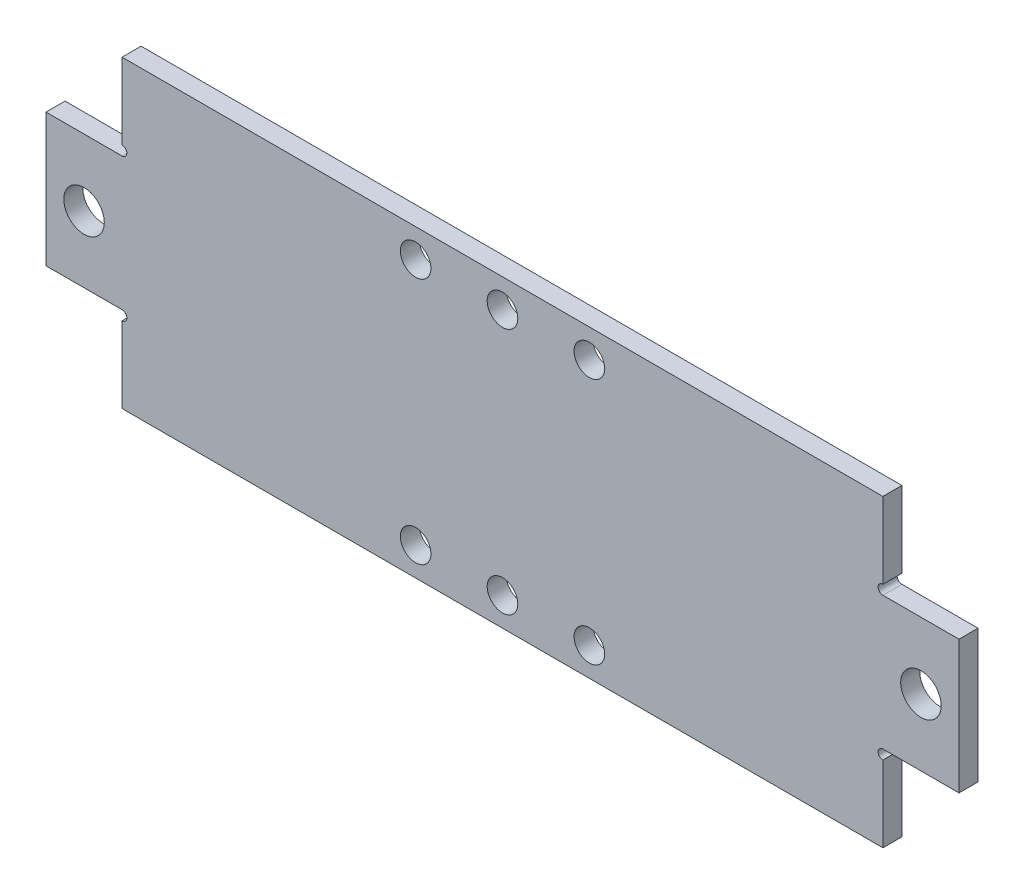
ISO-10303-21;
HEADER;
FILE_DESCRIPTION(('STEP AP214'),'2;1');
FILE_NAME('part.step','',(''),(''),'','','');
FILE_SCHEMA(('AUTOMOTIVE_DESIGN { 1 0 10303 214 1 1 1 1 }'));
ENDSEC;
DATA;
#1=APPLICATION_CONTEXT('core data for automotive mechanical design processes');
#2=APPLICATION_PROTOCOL_DEFINITION('international standard','automotive_design',2000,#1);
#3=PRODUCT_CONTEXT('',#1,'mechanical');
#4=PRODUCT('Part','Part','',(#3));
#5=PRODUCT_RELATED_PRODUCT_CATEGORY('part','',(#4));
#6=PRODUCT_DEFINITION_FORMATION('','',#4);
#7=PRODUCT_DEFINITION_CONTEXT('part definition',#1,'design');
#8=PRODUCT_DEFINITION('design','',#6,#7);
#9=PRODUCT_DEFINITION_SHAPE('','',#8);
#10=(LENGTH_UNIT() NAMED_UNIT(*) SI_UNIT(.MILLI.,.METRE.));
#11=(NAMED_UNIT(*) PLANE_ANGLE_UNIT() SI_UNIT($,.RADIAN.));
#12=(NAMED_UNIT(*) SI_UNIT($,.STERADIAN.) SOLID_ANGLE_UNIT());
#13=UNCERTAINTY_MEASURE_WITH_UNIT(LENGTH_MEASURE(1.E-05),#10,'distance_accuracy_value','');
#14=(GEOMETRIC_REPRESENTATION_CONTEXT(3) GLOBAL_UNCERTAINTY_ASSIGNED_CONTEXT((#13)) GLOBAL_UNIT_ASSIGNED_CONTEXT((#10,
#11,#12)) REPRESENTATION_CONTEXT('',''));
#15=CARTESIAN_POINT('',(0.,0.,0.));
#16=DIRECTION('',(0.,0.,1.));
#17=DIRECTION('',(1.,0.,0.));
#18=AXIS2_PLACEMENT_3D('',#15,#16,#17);
#19=CARTESIAN_POINT('',(0.,0.,3.175));
#20=DIRECTION('',(1.,0.,0.));
#21=DIRECTION('',(0.,0.,-1.));
#22=AXIS2_PLACEMENT_3D('',#19,#20,#21);
#23=PLANE('',#22);
#24=DIRECTION('',(0.,-1.,0.));
#25=VECTOR('',#24,1.);
#26=CARTESIAN_POINT('',(0.,0.,0.));
#27=LINE('',#26,#25);
#28=CARTESIAN_POINT('',(0.,36.5125,0.));
#29=VERTEX_POINT('',#28);
#30=CARTESIAN_POINT('',(0.,14.2875,0.));
#31=VERTEX_POINT('',#30);
#32=EDGE_CURVE('E229',#29,#31,#27,.T.);
#33=ORIENTED_EDGE('',*,*,#32,.T.);
#34=DIRECTION('',(0.,0.,1.));
#35=VECTOR('',#34,1.);
#36=CARTESIAN_POINT('',(0.,14.2875,0.));
#37=LINE('',#36,#35);
#38=CARTESIAN_POINT('',(0.,14.2875,3.175));
#39=VERTEX_POINT('',#38);
#40=EDGE_CURVE('E208',#31,#39,#37,.T.);
#41=ORIENTED_EDGE('',*,*,#40,.T.);
#42=DIRECTION('',(0.,-1.,0.));
#43=VECTOR('',#42,1.);
#44=CARTESIAN_POINT('',(0.,0.,3.175));
#45=LINE('',#44,#43);
#46=CARTESIAN_POINT('',(0.,36.5125,3.175));
#47=VERTEX_POINT('',#46);
#48=EDGE_CURVE('E233',#47,#39,#45,.T.);
#49=ORIENTED_EDGE('',*,*,#48,.F.);
#50=DIRECTION('',(0.,0.,1.));
#51=VECTOR('',#50,1.);
#52=CARTESIAN_POINT('',(0.,36.5125,0.));
#53=LINE('',#52,#51);
#54=EDGE_CURVE('E222',#29,#47,#53,.T.);
#55=ORIENTED_EDGE('',*,*,#54,.F.);
#56=EDGE_LOOP('',(#33,#41,#49,#55));
#57=FACE_BOUND('',#56,.T.);
#58=ADVANCED_FACE('F33',(#57),#23,.F.);
#59=CARTESIAN_POINT('',(0.,0.,3.175));
#60=DIRECTION('',(0.,1.,0.));
#61=DIRECTION('',(0.,0.,1.));
#62=AXIS2_PLACEMENT_3D('',#59,#60,#61);
#63=PLANE('',#62);
#64=DIRECTION('',(1.,0.,0.));
#65=VECTOR('',#64,1.);
#66=CARTESIAN_POINT('',(0.,0.,0.));
#67=LINE('',#66,#65);
#68=CARTESIAN_POINT('',(12.7,0.,0.));
#69=VERTEX_POINT('',#68);
#70=CARTESIAN_POINT('',(139.7,0.,0.));
#71=VERTEX_POINT('',#70);
#72=EDGE_CURVE('E246',#69,#71,#67,.T.);
#73=ORIENTED_EDGE('',*,*,#72,.T.);
#74=DIRECTION('',(0.,0.,1.));
#75=VECTOR('',#74,1.);
#76=CARTESIAN_POINT('',(139.7,0.,0.));
#77=LINE('',#76,#75);
#78=CARTESIAN_POINT('',(139.7,0.,3.175));
#79=VERTEX_POINT('',#78);
#80=EDGE_CURVE('E190',#71,#79,#77,.T.);
#81=ORIENTED_EDGE('',*,*,#80,.T.);
#82=DIRECTION('',(1.,0.,0.));
#83=VECTOR('',#82,1.);
#84=CARTESIAN_POINT('',(0.,0.,3.175));
#85=LINE('',#84,#83);
#86=CARTESIAN_POINT('',(12.7,0.,3.175));
#87=VERTEX_POINT('',#86);
#88=EDGE_CURVE('E236',#87,#79,#85,.T.);
#89=ORIENTED_EDGE('',*,*,#88,.F.);
#90=DIRECTION('',(0.,0.,1.));
#91=VECTOR('',#90,1.);
#92=CARTESIAN_POINT('',(12.7,0.,0.));
#93=LINE('',#92,#91);
#94=EDGE_CURVE('E204',#69,#87,#93,.T.);
#95=ORIENTED_EDGE('',*,*,#94,.F.);
#96=EDGE_LOOP('',(#73,#81,#89,#95));
#97=FACE_BOUND('',#96,.T.);
#98=ADVANCED_FACE('F266',(#97),#63,.F.);
#99=CARTESIAN_POINT('',(152.4,0.,3.175));
#100=DIRECTION('',(-1.,0.,0.));
#101=DIRECTION('',(0.,0.,1.));
#102=AXIS2_PLACEMENT_3D('',#99,#100,#101);
#103=PLANE('',#102);
#104=DIRECTION('',(0.,1.,0.));
#105=VECTOR('',#104,1.);
#106=CARTESIAN_POINT('',(152.4,0.,0.));
#107=LINE('',#106,#105);
#108=CARTESIAN_POINT('',(152.4,14.2875,0.));
#109=VERTEX_POINT('',#108);
#110=CARTESIAN_POINT('',(152.4,36.5125,0.));
#111=VERTEX_POINT('',#110);
#112=EDGE_CURVE('E249',#109,#111,#107,.T.);
#113=ORIENTED_EDGE('',*,*,#112,.T.);
#114=DIRECTION('',(0.,0.,1.));
#115=VECTOR('',#114,1.);
#116=CARTESIAN_POINT('',(152.4,36.5125,0.));
#117=LINE('',#116,#115);
#118=CARTESIAN_POINT('',(152.4,36.5125,3.175));
#119=VERTEX_POINT('',#118);
#120=EDGE_CURVE('E173',#111,#119,#117,.T.);
#121=ORIENTED_EDGE('',*,*,#120,.T.);
#122=DIRECTION('',(0.,1.,0.));
#123=VECTOR('',#122,1.);
#124=CARTESIAN_POINT('',(152.4,0.,3.175));
#125=LINE('',#124,#123);
#126=CARTESIAN_POINT('',(152.4,14.2875,3.175));
#127=VERTEX_POINT('',#126);
#128=EDGE_CURVE('E240',#127,#119,#125,.T.);
#129=ORIENTED_EDGE('',*,*,#128,.F.);
#130=DIRECTION('',(0.,0.,1.));
#131=VECTOR('',#130,1.);
#132=CARTESIAN_POINT('',(152.4,14.2875,0.));
#133=LINE('',#132,#131);
#134=EDGE_CURVE('E186',#109,#127,#133,.T.);
#135=ORIENTED_EDGE('',*,*,#134,.F.);
#136=EDGE_LOOP('',(#113,#121,#129,#135));
#137=FACE_BOUND('',#136,.T.);
#138=ADVANCED_FACE('F288',(#137),#103,.F.);
#139=CARTESIAN_POINT('',(0.,50.8,3.175));
#140=DIRECTION('',(0.,-1.,0.));
#141=DIRECTION('',(0.,0.,-1.));
#142=AXIS2_PLACEMENT_3D('',#139,#140,#141);
#143=PLANE('',#142);
#144=DIRECTION('',(-1.,0.,0.));
#145=VECTOR('',#144,1.);
#146=CARTESIAN_POINT('',(0.,50.8,3.175));
#147=LINE('',#146,#145);
#148=CARTESIAN_POINT('',(139.7,50.8,3.175));
#149=VERTEX_POINT('',#148);
#150=CARTESIAN_POINT('',(12.7,50.8,3.175));
#151=VERTEX_POINT('',#150);
#152=EDGE_CURVE('E242',#149,#151,#147,.T.);
#153=ORIENTED_EDGE('',*,*,#152,.F.);
#154=DIRECTION('',(0.,0.,1.));
#155=VECTOR('',#154,1.);
#156=CARTESIAN_POINT('',(139.7,50.8,0.));
#157=LINE('',#156,#155);
#158=CARTESIAN_POINT('',(139.7,50.8,0.));
#159=VERTEX_POINT('',#158);
#160=EDGE_CURVE('E161',#159,#149,#157,.T.);
#161=ORIENTED_EDGE('',*,*,#160,.F.);
#162=DIRECTION('',(-1.,0.,0.));
#163=VECTOR('',#162,1.);
#164=CARTESIAN_POINT('',(0.,50.8,0.));
#165=LINE('',#164,#163);
#166=CARTESIAN_POINT('',(12.7,50.8,0.));
#167=VERTEX_POINT('',#166);
#168=EDGE_CURVE('E237',#159,#167,#165,.T.);
#169=ORIENTED_EDGE('',*,*,#168,.T.);
#170=DIRECTION('',(0.,0.,1.));
#171=VECTOR('',#170,1.);
#172=CARTESIAN_POINT('',(12.7,50.8,0.));
#173=LINE('',#172,#171);
#174=EDGE_CURVE('E226',#167,#151,#173,.T.);
#175=ORIENTED_EDGE('',*,*,#174,.T.);
#176=EDGE_LOOP('',(#153,#161,#169,#175));
#177=FACE_BOUND('',#176,.T.);
#178=ADVANCED_FACE('F353',(#177),#143,.F.);
#179=CARTESIAN_POINT('',(0.,0.,3.175));
#180=DIRECTION('',(0.,0.,-1.));
#181=DIRECTION('',(-1.,0.,0.));
#182=AXIS2_PLACEMENT_3D('',#179,#180,#181);
#183=PLANE('',#182);
#184=CARTESIAN_POINT('',(76.2,4.7625,3.175));
#185=DIRECTION('',(0.,0.,1.));
#186=DIRECTION('',(1.,0.,0.));
#187=AXIS2_PLACEMENT_3D('',#184,#185,#186);
#188=CIRCLE('',#187,2.55270000000001);
#189=CARTESIAN_POINT('',(78.7527,4.7625,3.175));
#190=VERTEX_POINT('',#189);
#191=EDGE_CURVE('E345',#190,#190,#188,.T.);
#192=ORIENTED_EDGE('',*,*,#191,.F.);
#193=EDGE_LOOP('',(#192));
#194=FACE_BOUND('',#193,.T.);
#195=CARTESIAN_POINT('',(90.7,4.76250000000001,3.175));
#196=DIRECTION('',(0.,0.,1.));
#197=DIRECTION('',(1.,0.,0.));
#198=AXIS2_PLACEMENT_3D('',#195,#196,#197);
#199=CIRCLE('',#198,2.55270000000001);
#200=CARTESIAN_POINT('',(93.2527,4.76250000000001,3.175));
#201=VERTEX_POINT('',#200);
#202=EDGE_CURVE('E339',#201,#201,#199,.T.);
#203=ORIENTED_EDGE('',*,*,#202,.F.);
#204=EDGE_LOOP('',(#203));
#205=FACE_BOUND('',#204,.T.);
#206=CARTESIAN_POINT('',(61.7,4.7625,3.175));
#207=DIRECTION('',(0.,0.,1.));
#208=DIRECTION('',(1.,0.,0.));
#209=AXIS2_PLACEMENT_3D('',#206,#207,#208);
#210=CIRCLE('',#209,2.55270000000001);
#211=CARTESIAN_POINT('',(64.2527,4.7625,3.175));
#212=VERTEX_POINT('',#211);
#213=EDGE_CURVE('E333',#212,#212,#210,.T.);
#214=ORIENTED_EDGE('',*,*,#213,.F.);
#215=EDGE_LOOP('',(#214));
#216=FACE_BOUND('',#215,.T.);
#217=CARTESIAN_POINT('',(61.7,46.0375,3.175));
#218=DIRECTION('',(0.,0.,1.));
#219=DIRECTION('',(1.,0.,0.));
#220=AXIS2_PLACEMENT_3D('',#217,#218,#219);
#221=CIRCLE('',#220,2.55270000000001);
#222=CARTESIAN_POINT('',(64.2527,46.0375,3.175));
#223=VERTEX_POINT('',#222);
#224=EDGE_CURVE('E327',#223,#223,#221,.T.);
#225=ORIENTED_EDGE('',*,*,#224,.F.);
#226=EDGE_LOOP('',(#225));
#227=FACE_BOUND('',#226,.T.);
#228=CARTESIAN_POINT('',(76.2,46.0375,3.175));
#229=DIRECTION('',(0.,0.,1.));
#230=DIRECTION('',(1.,0.,0.));
#231=AXIS2_PLACEMENT_3D('',#228,#229,#230);
#232=CIRCLE('',#231,2.55270000000001);
#233=CARTESIAN_POINT('',(78.7527,46.0375,3.175));
#234=VERTEX_POINT('',#233);
#235=EDGE_CURVE('E321',#234,#234,#232,.T.);
#236=ORIENTED_EDGE('',*,*,#235,.F.);
#237=EDGE_LOOP('',(#236));
#238=FACE_BOUND('',#237,.T.);
#239=CARTESIAN_POINT('',(90.7,46.0375,3.175));
#240=DIRECTION('',(0.,0.,1.));
#241=DIRECTION('',(1.,0.,0.));
#242=AXIS2_PLACEMENT_3D('',#239,#240,#241);
#243=CIRCLE('',#242,2.55270000000001);
#244=CARTESIAN_POINT('',(93.2527,46.0375,3.175));
#245=VERTEX_POINT('',#244);
#246=EDGE_CURVE('E315',#245,#245,#243,.T.);
#247=ORIENTED_EDGE('',*,*,#246,.F.);
#248=EDGE_LOOP('',(#247));
#249=FACE_BOUND('',#248,.T.);
#250=CARTESIAN_POINT('',(6.35,25.4,3.175));
#251=DIRECTION('',(0.,0.,1.));
#252=DIRECTION('',(1.,0.,0.));
#253=AXIS2_PLACEMENT_3D('',#250,#251,#252);
#254=CIRCLE('',#253,3.37819999999999);
#255=CARTESIAN_POINT('',(9.72819999999999,25.4,3.175));
#256=VERTEX_POINT('',#255);
#257=EDGE_CURVE('E309',#256,#256,#254,.T.);
#258=ORIENTED_EDGE('',*,*,#257,.F.);
#259=EDGE_LOOP('',(#258));
#260=FACE_BOUND('',#259,.T.);
#261=CARTESIAN_POINT('',(146.05,25.4,3.175));
#262=DIRECTION('',(0.,0.,1.));
#263=DIRECTION('',(1.,0.,0.));
#264=AXIS2_PLACEMENT_3D('',#261,#262,#263);
#265=CIRCLE('',#264,3.3782);
#266=CARTESIAN_POINT('',(149.4282,25.4,3.175));
#267=VERTEX_POINT('',#266);
#268=EDGE_CURVE('E303',#267,#267,#265,.T.);
#269=ORIENTED_EDGE('',*,*,#268,.F.);
#270=EDGE_LOOP('',(#269));
#271=FACE_BOUND('',#270,.T.);
#272=DIRECTION('',(1.,0.,0.));
#273=VECTOR('',#272,1.);
#274=CARTESIAN_POINT('',(152.4,36.5125,3.175));
#275=LINE('',#274,#273);
#276=CARTESIAN_POINT('',(139.7,36.5125,3.175));
#277=VERTEX_POINT('',#276);
#278=EDGE_CURVE('E156',#277,#119,#275,.T.);
#279=ORIENTED_EDGE('',*,*,#278,.F.);
#280=CARTESIAN_POINT('',(139.7,37.30625,3.175));
#281=DIRECTION('',(0.,0.,1.));
#282=DIRECTION('',(1.,0.,0.));
#283=AXIS2_PLACEMENT_3D('',#280,#281,#282);
#284=CIRCLE('',#283,0.793750000000021);
#285=CARTESIAN_POINT('',(139.7,38.1,3.175));
#286=VERTEX_POINT('',#285);
#287=EDGE_CURVE('E143',#286,#277,#284,.T.);
#288=ORIENTED_EDGE('',*,*,#287,.F.);
#289=DIRECTION('',(0.,-1.,0.));
#290=VECTOR('',#289,1.);
#291=CARTESIAN_POINT('',(139.7,50.8,3.175));
#292=LINE('',#291,#290);
#293=EDGE_CURVE('E153',#149,#286,#292,.T.);
#294=ORIENTED_EDGE('',*,*,#293,.F.);
#295=ORIENTED_EDGE('',*,*,#152,.T.);
#296=DIRECTION('',(0.,1.,0.));
#297=VECTOR('',#296,1.);
#298=CARTESIAN_POINT('',(12.7,50.8,3.175));
#299=LINE('',#298,#297);
#300=CARTESIAN_POINT('',(12.7,38.1,3.175));
#301=VERTEX_POINT('',#300);
#302=EDGE_CURVE('E220',#301,#151,#299,.T.);
#303=ORIENTED_EDGE('',*,*,#302,.F.);
#304=CARTESIAN_POINT('',(12.7,37.30625,3.175));
#305=DIRECTION('',(0.,0.,1.));
#306=DIRECTION('',(1.,0.,0.));
#307=AXIS2_PLACEMENT_3D('',#304,#305,#306);
#308=CIRCLE('',#307,0.793749999999999);
#309=CARTESIAN_POINT('',(12.7,36.5125,3.175));
#310=VERTEX_POINT('',#309);
#311=EDGE_CURVE('E273',#310,#301,#308,.T.);
#312=ORIENTED_EDGE('',*,*,#311,.F.);
#313=DIRECTION('',(1.,0.,0.));
#314=VECTOR('',#313,1.);
#315=CARTESIAN_POINT('',(0.,36.5125,3.175));
#316=LINE('',#315,#314);
#317=EDGE_CURVE('E211',#47,#310,#316,.T.);
#318=ORIENTED_EDGE('',*,*,#317,.F.);
#319=ORIENTED_EDGE('',*,*,#48,.T.);
#320=DIRECTION('',(-1.,0.,0.));
#321=VECTOR('',#320,1.);
#322=CARTESIAN_POINT('',(0.,14.2875,3.175));
#323=LINE('',#322,#321);
#324=CARTESIAN_POINT('',(12.7,14.2875,3.175));
#325=VERTEX_POINT('',#324);
#326=EDGE_CURVE('E201',#325,#39,#323,.T.);
#327=ORIENTED_EDGE('',*,*,#326,.F.);
#328=CARTESIAN_POINT('',(12.7,13.49375,3.175));
#329=DIRECTION('',(0.,0.,1.));
#330=DIRECTION('',(1.,0.,0.));
#331=AXIS2_PLACEMENT_3D('',#328,#329,#330);
#332=CIRCLE('',#331,0.793749999999999);
#333=CARTESIAN_POINT('',(12.7,12.7,3.175));
#334=VERTEX_POINT('',#333);
#335=EDGE_CURVE('E270',#334,#325,#332,.T.);
#336=ORIENTED_EDGE('',*,*,#335,.F.);
#337=DIRECTION('',(0.,1.,0.));
#338=VECTOR('',#337,1.);
#339=CARTESIAN_POINT('',(12.7,0.,3.175));
#340=LINE('',#339,#338);
#341=EDGE_CURVE('E193',#87,#334,#340,.T.);
#342=ORIENTED_EDGE('',*,*,#341,.F.);
#343=ORIENTED_EDGE('',*,*,#88,.T.);
#344=DIRECTION('',(0.,-1.,0.));
#345=VECTOR('',#344,1.);
#346=CARTESIAN_POINT('',(139.7,0.,3.175));
#347=LINE('',#346,#345);
#348=CARTESIAN_POINT('',(139.7,12.7,3.175));
#349=VERTEX_POINT('',#348);
#350=EDGE_CURVE('E184',#349,#79,#347,.T.);
#351=ORIENTED_EDGE('',*,*,#350,.F.);
#352=CARTESIAN_POINT('',(139.7,13.49375,3.175));
#353=DIRECTION('',(0.,0.,1.));
#354=DIRECTION('',(1.,0.,0.));
#355=AXIS2_PLACEMENT_3D('',#352,#353,#354);
#356=CIRCLE('',#355,0.79375000000002);
#357=CARTESIAN_POINT('',(139.7,14.2875,3.175));
#358=VERTEX_POINT('',#357);
#359=EDGE_CURVE('E295',#358,#349,#356,.T.);
#360=ORIENTED_EDGE('',*,*,#359,.F.);
#361=DIRECTION('',(-1.,0.,0.));
#362=VECTOR('',#361,1.);
#363=CARTESIAN_POINT('',(152.4,14.2875,3.175));
#364=LINE('',#363,#362);
#365=EDGE_CURVE('E176',#127,#358,#364,.T.);
#366=ORIENTED_EDGE('',*,*,#365,.F.);
#367=ORIENTED_EDGE('',*,*,#128,.T.);
#368=EDGE_LOOP('',(#279,#288,#294,#295,#303,#312,#318,#319,#327,#336,#342,#343,#351,#360,#366,#367));
#369=FACE_BOUND('',#368,.T.);
#370=ADVANCED_FACE('F151',(#194,#205,#216,#227,#238,#249,#260,#271,#369),#183,.F.);
#371=CARTESIAN_POINT('',(0.,0.,0.));
#372=DIRECTION('',(0.,0.,-1.));
#373=DIRECTION('',(-1.,0.,0.));
#374=AXIS2_PLACEMENT_3D('',#371,#372,#373);
#375=PLANE('',#374);
#376=CARTESIAN_POINT('',(76.2,4.7625,0.));
#377=DIRECTION('',(0.,0.,1.));
#378=DIRECTION('',(1.,0.,0.));
#379=AXIS2_PLACEMENT_3D('',#376,#377,#378);
#380=CIRCLE('',#379,2.55270000000001);
#381=CARTESIAN_POINT('',(78.7527,4.7625,0.));
#382=VERTEX_POINT('',#381);
#383=EDGE_CURVE('E342',#382,#382,#380,.T.);
#384=ORIENTED_EDGE('',*,*,#383,.T.);
#385=EDGE_LOOP('',(#384));
#386=FACE_BOUND('',#385,.T.);
#387=CARTESIAN_POINT('',(90.7,4.76250000000001,0.));
#388=DIRECTION('',(0.,0.,1.));
#389=DIRECTION('',(1.,0.,0.));
#390=AXIS2_PLACEMENT_3D('',#387,#388,#389);
#391=CIRCLE('',#390,2.55270000000001);
#392=CARTESIAN_POINT('',(93.2527,4.76250000000001,0.));
#393=VERTEX_POINT('',#392);
#394=EDGE_CURVE('E336',#393,#393,#391,.T.);
#395=ORIENTED_EDGE('',*,*,#394,.T.);
#396=EDGE_LOOP('',(#395));
#397=FACE_BOUND('',#396,.T.);
#398=CARTESIAN_POINT('',(61.7,4.7625,0.));
#399=DIRECTION('',(0.,0.,1.));
#400=DIRECTION('',(1.,0.,0.));
#401=AXIS2_PLACEMENT_3D('',#398,#399,#400);
#402=CIRCLE('',#401,2.55270000000001);
#403=CARTESIAN_POINT('',(64.2527,4.7625,0.));
#404=VERTEX_POINT('',#403);
#405=EDGE_CURVE('E330',#404,#404,#402,.T.);
#406=ORIENTED_EDGE('',*,*,#405,.T.);
#407=EDGE_LOOP('',(#406));
#408=FACE_BOUND('',#407,.T.);
#409=CARTESIAN_POINT('',(61.7,46.0375,0.));
#410=DIRECTION('',(0.,0.,1.));
#411=DIRECTION('',(1.,0.,0.));
#412=AXIS2_PLACEMENT_3D('',#409,#410,#411);
#413=CIRCLE('',#412,2.55270000000001);
#414=CARTESIAN_POINT('',(64.2527,46.0375,0.));
#415=VERTEX_POINT('',#414);
#416=EDGE_CURVE('E324',#415,#415,#413,.T.);
#417=ORIENTED_EDGE('',*,*,#416,.T.);
#418=EDGE_LOOP('',(#417));
#419=FACE_BOUND('',#418,.T.);
#420=CARTESIAN_POINT('',(76.2,46.0375,0.));
#421=DIRECTION('',(0.,0.,1.));
#422=DIRECTION('',(1.,0.,0.));
#423=AXIS2_PLACEMENT_3D('',#420,#421,#422);
#424=CIRCLE('',#423,2.55270000000001);
#425=CARTESIAN_POINT('',(78.7527,46.0375,0.));
#426=VERTEX_POINT('',#425);
#427=EDGE_CURVE('E318',#426,#426,#424,.T.);
#428=ORIENTED_EDGE('',*,*,#427,.T.);
#429=EDGE_LOOP('',(#428));
#430=FACE_BOUND('',#429,.T.);
#431=CARTESIAN_POINT('',(90.7,46.0375,0.));
#432=DIRECTION('',(0.,0.,1.));
#433=DIRECTION('',(1.,0.,0.));
#434=AXIS2_PLACEMENT_3D('',#431,#432,#433);
#435=CIRCLE('',#434,2.55270000000001);
#436=CARTESIAN_POINT('',(93.2527,46.0375,0.));
#437=VERTEX_POINT('',#436);
#438=EDGE_CURVE('E312',#437,#437,#435,.T.);
#439=ORIENTED_EDGE('',*,*,#438,.T.);
#440=EDGE_LOOP('',(#439));
#441=FACE_BOUND('',#440,.T.);
#442=CARTESIAN_POINT('',(6.35,25.4,0.));
#443=DIRECTION('',(0.,0.,1.));
#444=DIRECTION('',(1.,0.,0.));
#445=AXIS2_PLACEMENT_3D('',#442,#443,#444);
#446=CIRCLE('',#445,3.3782);
#447=CARTESIAN_POINT('',(9.7282,25.4,0.));
#448=VERTEX_POINT('',#447);
#449=EDGE_CURVE('E306',#448,#448,#446,.T.);
#450=ORIENTED_EDGE('',*,*,#449,.T.);
#451=EDGE_LOOP('',(#450));
#452=FACE_BOUND('',#451,.T.);
#453=CARTESIAN_POINT('',(146.05,25.4,0.));
#454=DIRECTION('',(0.,0.,1.));
#455=DIRECTION('',(1.,0.,0.));
#456=AXIS2_PLACEMENT_3D('',#453,#454,#455);
#457=CIRCLE('',#456,3.3782);
#458=CARTESIAN_POINT('',(149.4282,25.4,0.));
#459=VERTEX_POINT('',#458);
#460=EDGE_CURVE('E157',#459,#459,#457,.T.);
#461=ORIENTED_EDGE('',*,*,#460,.T.);
#462=EDGE_LOOP('',(#461));
#463=FACE_BOUND('',#462,.T.);
#464=CARTESIAN_POINT('',(139.7,37.30625,0.));
#465=DIRECTION('',(0.,0.,1.));
#466=DIRECTION('',(1.,0.,0.));
#467=AXIS2_PLACEMENT_3D('',#464,#465,#466);
#468=CIRCLE('',#467,0.793750000000021);
#469=CARTESIAN_POINT('',(139.7,38.1,0.));
#470=VERTEX_POINT('',#469);
#471=CARTESIAN_POINT('',(139.7,36.5125,0.));
#472=VERTEX_POINT('',#471);
#473=EDGE_CURVE('E47',#470,#472,#468,.T.);
#474=ORIENTED_EDGE('',*,*,#473,.T.);
#475=DIRECTION('',(1.,0.,0.));
#476=VECTOR('',#475,1.);
#477=CARTESIAN_POINT('',(152.4,36.5125,0.));
#478=LINE('',#477,#476);
#479=EDGE_CURVE('E170',#472,#111,#478,.T.);
#480=ORIENTED_EDGE('',*,*,#479,.T.);
#481=ORIENTED_EDGE('',*,*,#112,.F.);
#482=DIRECTION('',(-1.,0.,0.));
#483=VECTOR('',#482,1.);
#484=CARTESIAN_POINT('',(152.4,14.2875,0.));
#485=LINE('',#484,#483);
#486=CARTESIAN_POINT('',(139.7,14.2875,0.));
#487=VERTEX_POINT('',#486);
#488=EDGE_CURVE('E180',#109,#487,#485,.T.);
#489=ORIENTED_EDGE('',*,*,#488,.T.);
#490=CARTESIAN_POINT('',(139.7,13.49375,0.));
#491=DIRECTION('',(0.,0.,1.));
#492=DIRECTION('',(1.,0.,0.));
#493=AXIS2_PLACEMENT_3D('',#490,#491,#492);
#494=CIRCLE('',#493,0.79375000000002);
#495=CARTESIAN_POINT('',(139.7,12.7,0.));
#496=VERTEX_POINT('',#495);
#497=EDGE_CURVE('E276',#487,#496,#494,.T.);
#498=ORIENTED_EDGE('',*,*,#497,.T.);
#499=DIRECTION('',(0.,-1.,0.));
#500=VECTOR('',#499,1.);
#501=CARTESIAN_POINT('',(139.7,0.,0.));
#502=LINE('',#501,#500);
#503=EDGE_CURVE('E183',#496,#71,#502,.T.);
#504=ORIENTED_EDGE('',*,*,#503,.T.);
#505=ORIENTED_EDGE('',*,*,#72,.F.);
#506=DIRECTION('',(0.,1.,0.));
#507=VECTOR('',#506,1.);
#508=CARTESIAN_POINT('',(12.7,0.,0.));
#509=LINE('',#508,#507);
#510=CARTESIAN_POINT('',(12.7,12.7,0.));
#511=VERTEX_POINT('',#510);
#512=EDGE_CURVE('E197',#69,#511,#509,.T.);
#513=ORIENTED_EDGE('',*,*,#512,.T.);
#514=CARTESIAN_POINT('',(12.7,13.49375,0.));
#515=DIRECTION('',(0.,0.,1.));
#516=DIRECTION('',(1.,0.,0.));
#517=AXIS2_PLACEMENT_3D('',#514,#515,#516);
#518=CIRCLE('',#517,0.793749999999999);
#519=CARTESIAN_POINT('',(12.7,14.2875,0.));
#520=VERTEX_POINT('',#519);
#521=EDGE_CURVE('E54',#511,#520,#518,.T.);
#522=ORIENTED_EDGE('',*,*,#521,.T.);
#523=DIRECTION('',(-1.,0.,0.));
#524=VECTOR('',#523,1.);
#525=CARTESIAN_POINT('',(0.,14.2875,0.));
#526=LINE('',#525,#524);
#527=EDGE_CURVE('E200',#520,#31,#526,.T.);
#528=ORIENTED_EDGE('',*,*,#527,.T.);
#529=ORIENTED_EDGE('',*,*,#32,.F.);
#530=DIRECTION('',(1.,0.,0.));
#531=VECTOR('',#530,1.);
#532=CARTESIAN_POINT('',(0.,36.5125,0.));
#533=LINE('',#532,#531);
#534=CARTESIAN_POINT('',(12.7,36.5125,0.));
#535=VERTEX_POINT('',#534);
#536=EDGE_CURVE('E216',#29,#535,#533,.T.);
#537=ORIENTED_EDGE('',*,*,#536,.T.);
#538=CARTESIAN_POINT('',(12.7,37.30625,0.));
#539=DIRECTION('',(0.,0.,1.));
#540=DIRECTION('',(1.,0.,0.));
#541=AXIS2_PLACEMENT_3D('',#538,#539,#540);
#542=CIRCLE('',#541,0.793749999999999);
#543=CARTESIAN_POINT('',(12.7,38.1,0.));
#544=VERTEX_POINT('',#543);
#545=EDGE_CURVE('E167',#535,#544,#542,.T.);
#546=ORIENTED_EDGE('',*,*,#545,.T.);
#547=DIRECTION('',(0.,1.,0.));
#548=VECTOR('',#547,1.);
#549=CARTESIAN_POINT('',(12.7,50.8,0.));
#550=LINE('',#549,#548);
#551=EDGE_CURVE('E219',#544,#167,#550,.T.);
#552=ORIENTED_EDGE('',*,*,#551,.T.);
#553=ORIENTED_EDGE('',*,*,#168,.F.);
#554=DIRECTION('',(0.,-1.,0.));
#555=VECTOR('',#554,1.);
#556=CARTESIAN_POINT('',(139.7,50.8,0.));
#557=LINE('',#556,#555);
#558=EDGE_CURVE('E164',#159,#470,#557,.T.);
#559=ORIENTED_EDGE('',*,*,#558,.T.);
#560=EDGE_LOOP('',(#474,#480,#481,#489,#498,#504,#505,#513,#522,#528,#529,#537,#546,#552,#553,#559));
#561=FACE_BOUND('',#560,.T.);
#562=ADVANCED_FACE('F260',(#386,#397,#408,#419,#430,#441,#452,#463,#561),#375,.T.);
#563=CARTESIAN_POINT('',(12.7,50.8,0.));
#564=DIRECTION('',(1.,0.,0.));
#565=DIRECTION('',(0.,0.,-1.));
#566=AXIS2_PLACEMENT_3D('',#563,#564,#565);
#567=PLANE('',#566);
#568=ORIENTED_EDGE('',*,*,#551,.F.);
#569=DIRECTION('',(0.,0.,1.));
#570=VECTOR('',#569,1.);
#571=CARTESIAN_POINT('',(12.7,38.1,0.));
#572=LINE('',#571,#570);
#573=EDGE_CURVE('E162',#544,#301,#572,.T.);
#574=ORIENTED_EDGE('',*,*,#573,.T.);
#575=ORIENTED_EDGE('',*,*,#302,.T.);
#576=ORIENTED_EDGE('',*,*,#174,.F.);
#577=EDGE_LOOP('',(#568,#574,#575,#576));
#578=FACE_BOUND('',#577,.T.);
#579=ADVANCED_FACE('F422',(#578),#567,.F.);
#580=CARTESIAN_POINT('',(0.,36.5125,0.));
#581=DIRECTION('',(0.,-1.,0.));
#582=DIRECTION('',(0.,0.,-1.));
#583=AXIS2_PLACEMENT_3D('',#580,#581,#582);
#584=PLANE('',#583);
#585=ORIENTED_EDGE('',*,*,#317,.T.);
#586=DIRECTION('',(0.,0.,1.));
#587=VECTOR('',#586,1.);
#588=CARTESIAN_POINT('',(12.7,36.5125,0.));
#589=LINE('',#588,#587);
#590=EDGE_CURVE('E230',#535,#310,#589,.T.);
#591=ORIENTED_EDGE('',*,*,#590,.F.);
#592=ORIENTED_EDGE('',*,*,#536,.F.);
#593=ORIENTED_EDGE('',*,*,#54,.T.);
#594=EDGE_LOOP('',(#585,#591,#592,#593));
#595=FACE_BOUND('',#594,.T.);
#596=ADVANCED_FACE('F419',(#595),#584,.F.);
#597=CARTESIAN_POINT('',(0.,14.2875,0.));
#598=DIRECTION('',(0.,1.,0.));
#599=DIRECTION('',(0.,0.,1.));
#600=AXIS2_PLACEMENT_3D('',#597,#598,#599);
#601=PLANE('',#600);
#602=ORIENTED_EDGE('',*,*,#326,.T.);
#603=ORIENTED_EDGE('',*,*,#40,.F.);
#604=ORIENTED_EDGE('',*,*,#527,.F.);
#605=DIRECTION('',(0.,0.,1.));
#606=VECTOR('',#605,1.);
#607=CARTESIAN_POINT('',(12.7,14.2875,0.));
#608=LINE('',#607,#606);
#609=EDGE_CURVE('E212',#520,#325,#608,.T.);
#610=ORIENTED_EDGE('',*,*,#609,.T.);
#611=EDGE_LOOP('',(#602,#603,#604,#610));
#612=FACE_BOUND('',#611,.T.);
#613=ADVANCED_FACE('F393',(#612),#601,.F.);
#614=CARTESIAN_POINT('',(12.7,0.,0.));
#615=DIRECTION('',(1.,0.,0.));
#616=DIRECTION('',(0.,0.,-1.));
#617=AXIS2_PLACEMENT_3D('',#614,#615,#616);
#618=PLANE('',#617);
#619=ORIENTED_EDGE('',*,*,#341,.T.);
#620=DIRECTION('',(0.,0.,1.));
#621=VECTOR('',#620,1.);
#622=CARTESIAN_POINT('',(12.7,12.7,0.));
#623=LINE('',#622,#621);
#624=EDGE_CURVE('E40',#334,#511,#623,.F.);
#625=ORIENTED_EDGE('',*,*,#624,.T.);
#626=ORIENTED_EDGE('',*,*,#512,.F.);
#627=ORIENTED_EDGE('',*,*,#94,.T.);
#628=EDGE_LOOP('',(#619,#625,#626,#627));
#629=FACE_BOUND('',#628,.T.);
#630=ADVANCED_FACE('F254',(#629),#618,.F.);
#631=CARTESIAN_POINT('',(139.7,0.,0.));
#632=DIRECTION('',(-1.,0.,0.));
#633=DIRECTION('',(0.,-1.,0.));
#634=AXIS2_PLACEMENT_3D('',#631,#632,#633);
#635=PLANE('',#634);
#636=ORIENTED_EDGE('',*,*,#503,.F.);
#637=DIRECTION('',(0.,0.,1.));
#638=VECTOR('',#637,1.);
#639=CARTESIAN_POINT('',(139.7,12.7,0.));
#640=LINE('',#639,#638);
#641=EDGE_CURVE('E271',#496,#349,#640,.T.);
#642=ORIENTED_EDGE('',*,*,#641,.T.);
#643=ORIENTED_EDGE('',*,*,#350,.T.);
#644=ORIENTED_EDGE('',*,*,#80,.F.);
#645=EDGE_LOOP('',(#636,#642,#643,#644));
#646=FACE_BOUND('',#645,.T.);
#647=ADVANCED_FACE('F411',(#646),#635,.F.);
#648=CARTESIAN_POINT('',(152.4,14.2875,0.));
#649=DIRECTION('',(0.,1.,0.));
#650=DIRECTION('',(-1.,0.,0.));
#651=AXIS2_PLACEMENT_3D('',#648,#649,#650);
#652=PLANE('',#651);
#653=ORIENTED_EDGE('',*,*,#365,.T.);
#654=DIRECTION('',(0.,0.,1.));
#655=VECTOR('',#654,1.);
#656=CARTESIAN_POINT('',(139.7,14.2875,0.));
#657=LINE('',#656,#655);
#658=EDGE_CURVE('E194',#487,#358,#657,.T.);
#659=ORIENTED_EDGE('',*,*,#658,.F.);
#660=ORIENTED_EDGE('',*,*,#488,.F.);
#661=ORIENTED_EDGE('',*,*,#134,.T.);
#662=EDGE_LOOP('',(#653,#659,#660,#661));
#663=FACE_BOUND('',#662,.T.);
#664=ADVANCED_FACE('F292',(#663),#652,.F.);
#665=CARTESIAN_POINT('',(152.4,36.5125,0.));
#666=DIRECTION('',(0.,-1.,0.));
#667=DIRECTION('',(0.,0.,-1.));
#668=AXIS2_PLACEMENT_3D('',#665,#666,#667);
#669=PLANE('',#668);
#670=ORIENTED_EDGE('',*,*,#278,.T.);
#671=ORIENTED_EDGE('',*,*,#120,.F.);
#672=ORIENTED_EDGE('',*,*,#479,.F.);
#673=DIRECTION('',(0.,0.,1.));
#674=VECTOR('',#673,1.);
#675=CARTESIAN_POINT('',(139.7,36.5125,0.));
#676=LINE('',#675,#674);
#677=EDGE_CURVE('E177',#472,#277,#676,.T.);
#678=ORIENTED_EDGE('',*,*,#677,.T.);
#679=EDGE_LOOP('',(#670,#671,#672,#678));
#680=FACE_BOUND('',#679,.T.);
#681=ADVANCED_FACE('F406',(#680),#669,.F.);
#682=CARTESIAN_POINT('',(139.7,50.8,0.));
#683=DIRECTION('',(-1.,0.,0.));
#684=DIRECTION('',(0.,0.,1.));
#685=AXIS2_PLACEMENT_3D('',#682,#683,#684);
#686=PLANE('',#685);
#687=ORIENTED_EDGE('',*,*,#293,.T.);
#688=DIRECTION('',(0.,0.,1.));
#689=VECTOR('',#688,1.);
#690=CARTESIAN_POINT('',(139.7,38.1,0.));
#691=LINE('',#690,#689);
#692=EDGE_CURVE('E11',#286,#470,#691,.F.);
#693=ORIENTED_EDGE('',*,*,#692,.T.);
#694=ORIENTED_EDGE('',*,*,#558,.F.);
#695=ORIENTED_EDGE('',*,*,#160,.T.);
#696=EDGE_LOOP('',(#687,#693,#694,#695));
#697=FACE_BOUND('',#696,.T.);
#698=ADVANCED_FACE('F159',(#697),#686,.F.);
#699=CARTESIAN_POINT('',(12.7,37.30625,0.));
#700=DIRECTION('',(0.,0.,1.));
#701=DIRECTION('',(1.,0.,0.));
#702=AXIS2_PLACEMENT_3D('',#699,#700,#701);
#703=CYLINDRICAL_SURFACE('',#702,0.793749999999999);
#704=ORIENTED_EDGE('',*,*,#545,.F.);
#705=ORIENTED_EDGE('',*,*,#590,.T.);
#706=ORIENTED_EDGE('',*,*,#311,.T.);
#707=ORIENTED_EDGE('',*,*,#573,.F.);
#708=EDGE_LOOP('',(#704,#705,#706,#707));
#709=FACE_BOUND('',#708,.T.);
#710=ADVANCED_FACE('F396',(#709),#703,.F.);
#711=CARTESIAN_POINT('',(12.7,13.49375,0.));
#712=DIRECTION('',(0.,0.,1.));
#713=DIRECTION('',(1.,0.,0.));
#714=AXIS2_PLACEMENT_3D('',#711,#712,#713);
#715=CYLINDRICAL_SURFACE('',#714,0.793749999999999);
#716=ORIENTED_EDGE('',*,*,#521,.F.);
#717=ORIENTED_EDGE('',*,*,#624,.F.);
#718=ORIENTED_EDGE('',*,*,#335,.T.);
#719=ORIENTED_EDGE('',*,*,#609,.F.);
#720=EDGE_LOOP('',(#716,#717,#718,#719));
#721=FACE_BOUND('',#720,.T.);
#722=ADVANCED_FACE('F394',(#721),#715,.F.);
#723=CARTESIAN_POINT('',(139.7,13.49375,0.));
#724=DIRECTION('',(0.,0.,1.));
#725=DIRECTION('',(1.,0.,0.));
#726=AXIS2_PLACEMENT_3D('',#723,#724,#725);
#727=CYLINDRICAL_SURFACE('',#726,0.79375000000002);
#728=ORIENTED_EDGE('',*,*,#497,.F.);
#729=ORIENTED_EDGE('',*,*,#658,.T.);
#730=ORIENTED_EDGE('',*,*,#359,.T.);
#731=ORIENTED_EDGE('',*,*,#641,.F.);
#732=EDGE_LOOP('',(#728,#729,#730,#731));
#733=FACE_BOUND('',#732,.T.);
#734=ADVANCED_FACE('F381',(#733),#727,.F.);
#735=CARTESIAN_POINT('',(139.7,37.30625,0.));
#736=DIRECTION('',(0.,0.,1.));
#737=DIRECTION('',(1.,0.,0.));
#738=AXIS2_PLACEMENT_3D('',#735,#736,#737);
#739=CYLINDRICAL_SURFACE('',#738,0.793750000000021);
#740=ORIENTED_EDGE('',*,*,#473,.F.);
#741=ORIENTED_EDGE('',*,*,#692,.F.);
#742=ORIENTED_EDGE('',*,*,#287,.T.);
#743=ORIENTED_EDGE('',*,*,#677,.F.);
#744=EDGE_LOOP('',(#740,#741,#742,#743));
#745=FACE_BOUND('',#744,.T.);
#746=ADVANCED_FACE('F142',(#745),#739,.F.);
#747=CARTESIAN_POINT('',(146.05,25.4,3.175));
#748=DIRECTION('',(0.,0.,1.));
#749=DIRECTION('',(1.,0.,0.));
#750=AXIS2_PLACEMENT_3D('',#747,#748,#749);
#751=CYLINDRICAL_SURFACE('',#750,3.3782);
#752=ORIENTED_EDGE('',*,*,#460,.F.);
#753=EDGE_LOOP('',(#752));
#754=FACE_BOUND('',#753,.T.);
#755=ORIENTED_EDGE('',*,*,#268,.T.);
#756=EDGE_LOOP('',(#755));
#757=FACE_BOUND('',#756,.T.);
#758=ADVANCED_FACE('F369',(#754,#757),#751,.F.);
#759=CARTESIAN_POINT('',(6.35,25.4,3.175));
#760=DIRECTION('',(0.,0.,1.));
#761=DIRECTION('',(1.,0.,0.));
#762=AXIS2_PLACEMENT_3D('',#759,#760,#761);
#763=CYLINDRICAL_SURFACE('',#762,3.37819999999999);
#764=ORIENTED_EDGE('',*,*,#449,.F.);
#765=EDGE_LOOP('',(#764));
#766=FACE_BOUND('',#765,.T.);
#767=ORIENTED_EDGE('',*,*,#257,.T.);
#768=EDGE_LOOP('',(#767));
#769=FACE_BOUND('',#768,.T.);
#770=ADVANCED_FACE('F371',(#766,#769),#763,.F.);
#771=CARTESIAN_POINT('',(90.7,46.0375,3.175));
#772=DIRECTION('',(0.,0.,1.));
#773=DIRECTION('',(1.,0.,0.));
#774=AXIS2_PLACEMENT_3D('',#771,#772,#773);
#775=CYLINDRICAL_SURFACE('',#774,2.55270000000001);
#776=ORIENTED_EDGE('',*,*,#438,.F.);
#777=EDGE_LOOP('',(#776));
#778=FACE_BOUND('',#777,.T.);
#779=ORIENTED_EDGE('',*,*,#246,.T.);
#780=EDGE_LOOP('',(#779));
#781=FACE_BOUND('',#780,.T.);
#782=ADVANCED_FACE('F378',(#778,#781),#775,.F.);
#783=CARTESIAN_POINT('',(76.2,46.0375,3.175));
#784=DIRECTION('',(0.,0.,1.));
#785=DIRECTION('',(1.,0.,0.));
#786=AXIS2_PLACEMENT_3D('',#783,#784,#785);
#787=CYLINDRICAL_SURFACE('',#786,2.55270000000001);
#788=ORIENTED_EDGE('',*,*,#427,.F.);
#789=EDGE_LOOP('',(#788));
#790=FACE_BOUND('',#789,.T.);
#791=ORIENTED_EDGE('',*,*,#235,.T.);
#792=EDGE_LOOP('',(#791));
#793=FACE_BOUND('',#792,.T.);
#794=ADVANCED_FACE('F527',(#790,#793),#787,.F.);
#795=CARTESIAN_POINT('',(61.7,46.0375,3.175));
#796=DIRECTION('',(0.,0.,1.));
#797=DIRECTION('',(1.,0.,0.));
#798=AXIS2_PLACEMENT_3D('',#795,#796,#797);
#799=CYLINDRICAL_SURFACE('',#798,2.55270000000001);
#800=ORIENTED_EDGE('',*,*,#416,.F.);
#801=EDGE_LOOP('',(#800));
#802=FACE_BOUND('',#801,.T.);
#803=ORIENTED_EDGE('',*,*,#224,.T.);
#804=EDGE_LOOP('',(#803));
#805=FACE_BOUND('',#804,.T.);
#806=ADVANCED_FACE('F534',(#802,#805),#799,.F.);
#807=CARTESIAN_POINT('',(61.7,4.7625,3.175));
#808=DIRECTION('',(0.,0.,1.));
#809=DIRECTION('',(1.,0.,0.));
#810=AXIS2_PLACEMENT_3D('',#807,#808,#809);
#811=CYLINDRICAL_SURFACE('',#810,2.55270000000001);
#812=ORIENTED_EDGE('',*,*,#405,.F.);
#813=EDGE_LOOP('',(#812));
#814=FACE_BOUND('',#813,.T.);
#815=ORIENTED_EDGE('',*,*,#213,.T.);
#816=EDGE_LOOP('',(#815));
#817=FACE_BOUND('',#816,.T.);
#818=ADVANCED_FACE('F542',(#814,#817),#811,.F.);
#819=CARTESIAN_POINT('',(90.7,4.76250000000001,3.175));
#820=DIRECTION('',(0.,0.,1.));
#821=DIRECTION('',(1.,0.,0.));
#822=AXIS2_PLACEMENT_3D('',#819,#820,#821);
#823=CYLINDRICAL_SURFACE('',#822,2.55270000000001);
#824=ORIENTED_EDGE('',*,*,#394,.F.);
#825=EDGE_LOOP('',(#824));
#826=FACE_BOUND('',#825,.T.);
#827=ORIENTED_EDGE('',*,*,#202,.T.);
#828=EDGE_LOOP('',(#827));
#829=FACE_BOUND('',#828,.T.);
#830=ADVANCED_FACE('F550',(#826,#829),#823,.F.);
#831=CARTESIAN_POINT('',(76.2,4.7625,3.175));
#832=DIRECTION('',(0.,0.,1.));
#833=DIRECTION('',(1.,0.,0.));
#834=AXIS2_PLACEMENT_3D('',#831,#832,#833);
#835=CYLINDRICAL_SURFACE('',#834,2.55270000000001);
#836=ORIENTED_EDGE('',*,*,#383,.F.);
#837=EDGE_LOOP('',(#836));
#838=FACE_BOUND('',#837,.T.);
#839=ORIENTED_EDGE('',*,*,#191,.T.);
#840=EDGE_LOOP('',(#839));
#841=FACE_BOUND('',#840,.T.);
#842=ADVANCED_FACE('F349',(#838,#841),#835,.F.);
#843=CLOSED_SHELL('',(#58,#98,#138,#178,#370,#562,#579,#596,#613,#630,#647,#664,#681,#698,#710,
#722,#734,#746,#758,#770,#782,#794,#806,#818,#830,#842));
#844=MANIFOLD_SOLID_BREP('B2',#843);
#845=ADVANCED_BREP_SHAPE_REPRESENTATION('',(#18,#844),#14);
#846=SHAPE_DEFINITION_REPRESENTATION(#9,#845);
ENDSEC;
END-ISO-10303-21;
